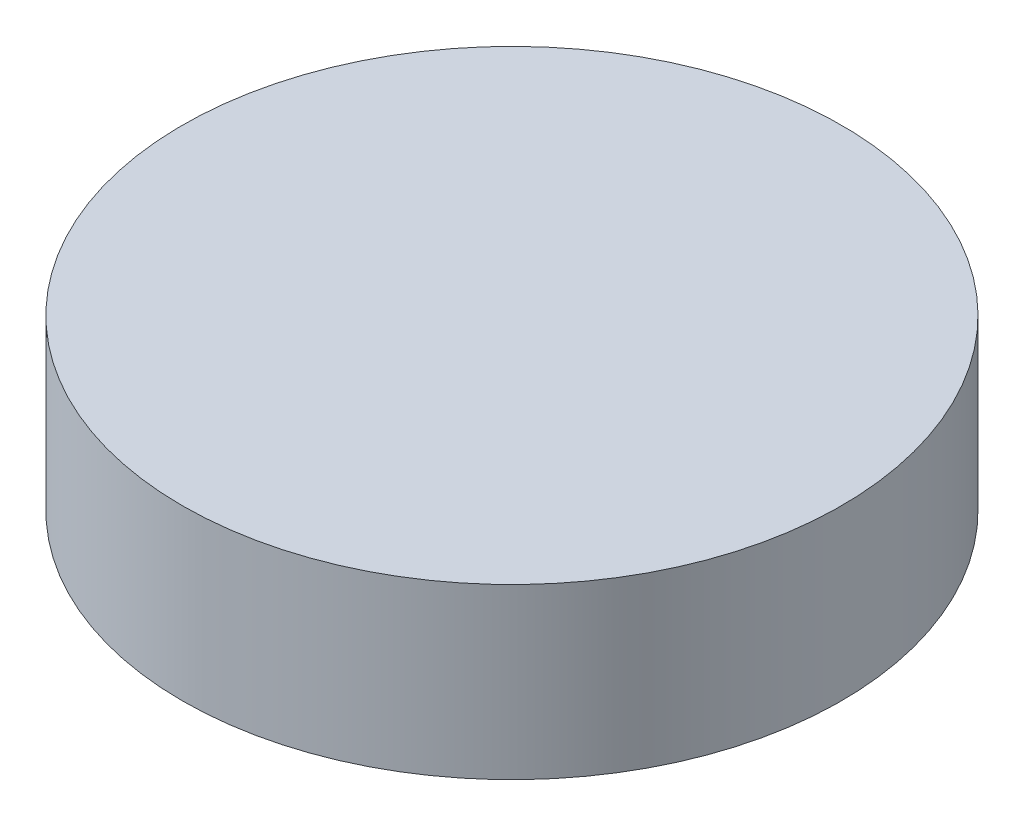
ISO-10303-21;
HEADER;
FILE_DESCRIPTION(('STEP AP214'),'2;1');
FILE_NAME('part.step','',(''),(''),'','','');
FILE_SCHEMA(('AUTOMOTIVE_DESIGN { 1 0 10303 214 1 1 1 1 }'));
ENDSEC;
DATA;
#1=APPLICATION_CONTEXT('core data for automotive mechanical design processes');
#2=APPLICATION_PROTOCOL_DEFINITION('international standard','automotive_design',2000,#1);
#3=PRODUCT_CONTEXT('',#1,'mechanical');
#4=PRODUCT('Part','Part','',(#3));
#5=PRODUCT_RELATED_PRODUCT_CATEGORY('part','',(#4));
#6=PRODUCT_DEFINITION_FORMATION('','',#4);
#7=PRODUCT_DEFINITION_CONTEXT('part definition',#1,'design');
#8=PRODUCT_DEFINITION('design','',#6,#7);
#9=PRODUCT_DEFINITION_SHAPE('','',#8);
#10=(LENGTH_UNIT() NAMED_UNIT(*) SI_UNIT(.MILLI.,.METRE.));
#11=(NAMED_UNIT(*) PLANE_ANGLE_UNIT() SI_UNIT($,.RADIAN.));
#12=(NAMED_UNIT(*) SI_UNIT($,.STERADIAN.) SOLID_ANGLE_UNIT());
#13=UNCERTAINTY_MEASURE_WITH_UNIT(LENGTH_MEASURE(1.E-05),#10,'distance_accuracy_value','');
#14=(GEOMETRIC_REPRESENTATION_CONTEXT(3) GLOBAL_UNCERTAINTY_ASSIGNED_CONTEXT((#13)) GLOBAL_UNIT_ASSIGNED_CONTEXT((#10,
#11,#12)) REPRESENTATION_CONTEXT('',''));
#15=CARTESIAN_POINT('',(0.,0.,0.));
#16=DIRECTION('',(0.,0.,1.));
#17=DIRECTION('',(1.,0.,0.));
#18=AXIS2_PLACEMENT_3D('',#15,#16,#17);
#19=CARTESIAN_POINT('',(0.,10.,0.));
#20=DIRECTION('',(0.,-1.,0.));
#21=DIRECTION('',(0.,0.,-1.));
#22=AXIS2_PLACEMENT_3D('',#19,#20,#21);
#23=CYLINDRICAL_SURFACE('',#22,19.5);
#24=CARTESIAN_POINT('',(0.,10.,0.));
#25=DIRECTION('',(0.,1.,0.));
#26=DIRECTION('',(0.,0.,1.));
#27=AXIS2_PLACEMENT_3D('',#24,#25,#26);
#28=CIRCLE('',#27,19.5);
#29=CARTESIAN_POINT('',(0.,10.,19.5));
#30=VERTEX_POINT('',#29);
#31=EDGE_CURVE('E10',#30,#30,#28,.T.);
#32=ORIENTED_EDGE('',*,*,#31,.F.);
#33=EDGE_LOOP('',(#32));
#34=FACE_BOUND('',#33,.T.);
#35=CARTESIAN_POINT('',(0.,0.,0.));
#36=DIRECTION('',(0.,1.,0.));
#37=DIRECTION('',(0.,0.,1.));
#38=AXIS2_PLACEMENT_3D('',#35,#36,#37);
#39=CIRCLE('',#38,19.5);
#40=CARTESIAN_POINT('',(0.,0.,19.5));
#41=VERTEX_POINT('',#40);
#42=EDGE_CURVE('E40',#41,#41,#39,.T.);
#43=ORIENTED_EDGE('',*,*,#42,.T.);
#44=EDGE_LOOP('',(#43));
#45=FACE_BOUND('',#44,.T.);
#46=ADVANCED_FACE('F37',(#34,#45),#23,.T.);
#47=CARTESIAN_POINT('',(0.,10.,0.));
#48=DIRECTION('',(0.,1.,0.));
#49=DIRECTION('',(0.,0.,1.));
#50=AXIS2_PLACEMENT_3D('',#47,#48,#49);
#51=PLANE('',#50);
#52=ORIENTED_EDGE('',*,*,#31,.T.);
#53=EDGE_LOOP('',(#52));
#54=FACE_BOUND('',#53,.T.);
#55=ADVANCED_FACE('F54',(#54),#51,.T.);
#56=CARTESIAN_POINT('',(0.,0.,0.));
#57=DIRECTION('',(0.,1.,0.));
#58=DIRECTION('',(0.,0.,1.));
#59=AXIS2_PLACEMENT_3D('',#56,#57,#58);
#60=PLANE('',#59);
#61=ORIENTED_EDGE('',*,*,#42,.F.);
#62=EDGE_LOOP('',(#61));
#63=FACE_BOUND('',#62,.T.);
#64=ADVANCED_FACE('F52',(#63),#60,.F.);
#65=CLOSED_SHELL('',(#46,#55,#64));
#66=MANIFOLD_SOLID_BREP('B2',#65);
#67=ADVANCED_BREP_SHAPE_REPRESENTATION('',(#18,#66),#14);
#68=SHAPE_DEFINITION_REPRESENTATION(#9,#67);
ENDSEC;
END-ISO-10303-21;
